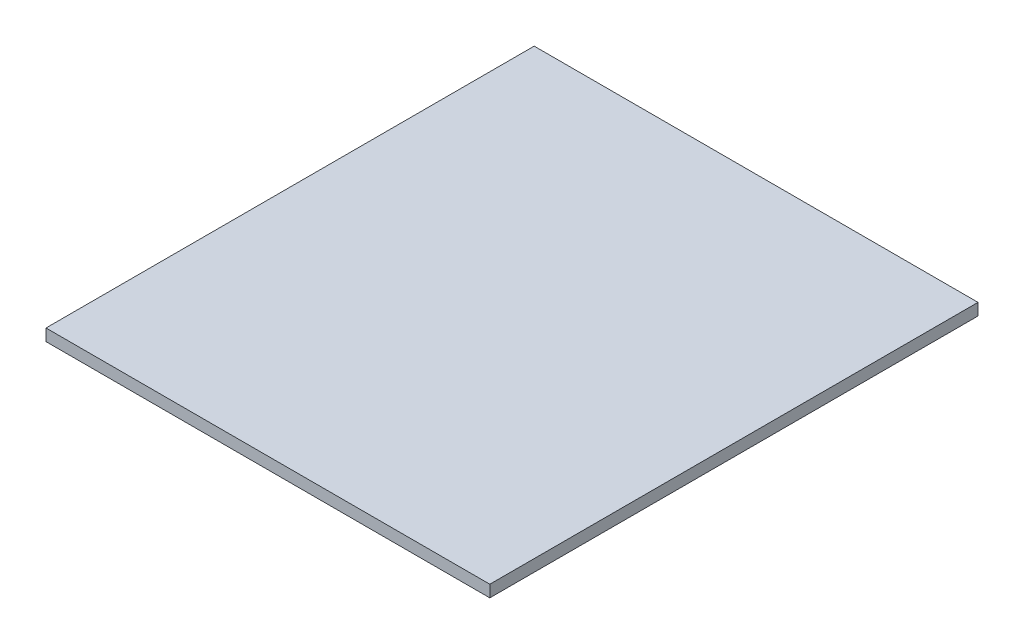
ISO-10303-21;
HEADER;
FILE_DESCRIPTION(('STEP AP214'),'2;1');
FILE_NAME('part.step','',(''),(''),'','','');
FILE_SCHEMA(('AUTOMOTIVE_DESIGN { 1 0 10303 214 1 1 1 1 }'));
ENDSEC;
DATA;
#1=APPLICATION_CONTEXT('core data for automotive mechanical design processes');
#2=APPLICATION_PROTOCOL_DEFINITION('international standard','automotive_design',2000,#1);
#3=PRODUCT_CONTEXT('',#1,'mechanical');
#4=PRODUCT('Part','Part','',(#3));
#5=PRODUCT_RELATED_PRODUCT_CATEGORY('part','',(#4));
#6=PRODUCT_DEFINITION_FORMATION('','',#4);
#7=PRODUCT_DEFINITION_CONTEXT('part definition',#1,'design');
#8=PRODUCT_DEFINITION('design','',#6,#7);
#9=PRODUCT_DEFINITION_SHAPE('','',#8);
#10=(LENGTH_UNIT() NAMED_UNIT(*) SI_UNIT(.MILLI.,.METRE.));
#11=(NAMED_UNIT(*) PLANE_ANGLE_UNIT() SI_UNIT($,.RADIAN.));
#12=(NAMED_UNIT(*) SI_UNIT($,.STERADIAN.) SOLID_ANGLE_UNIT());
#13=UNCERTAINTY_MEASURE_WITH_UNIT(LENGTH_MEASURE(1.E-05),#10,'distance_accuracy_value','');
#14=(GEOMETRIC_REPRESENTATION_CONTEXT(3) GLOBAL_UNCERTAINTY_ASSIGNED_CONTEXT((#13)) GLOBAL_UNIT_ASSIGNED_CONTEXT((#10,
#11,#12)) REPRESENTATION_CONTEXT('',''));
#15=CARTESIAN_POINT('',(0.,0.,0.));
#16=DIRECTION('',(0.,0.,1.));
#17=DIRECTION('',(1.,0.,0.));
#18=AXIS2_PLACEMENT_3D('',#15,#16,#17);
#19=CARTESIAN_POINT('',(0.,4.,0.));
#20=DIRECTION('',(1.,0.,0.));
#21=DIRECTION('',(0.,0.,-1.));
#22=AXIS2_PLACEMENT_3D('',#19,#20,#21);
#23=PLANE('',#22);
#24=DIRECTION('',(0.,0.,1.));
#25=VECTOR('',#24,1.);
#26=CARTESIAN_POINT('',(0.,0.,0.));
#27=LINE('',#26,#25);
#28=CARTESIAN_POINT('',(0.,0.,-165.));
#29=VERTEX_POINT('',#28);
#30=CARTESIAN_POINT('',(0.,0.,0.));
#31=VERTEX_POINT('',#30);
#32=EDGE_CURVE('E101',#29,#31,#27,.T.);
#33=ORIENTED_EDGE('',*,*,#32,.T.);
#34=DIRECTION('',(0.,-1.,0.));
#35=VECTOR('',#34,1.);
#36=CARTESIAN_POINT('',(0.,4.,0.));
#37=LINE('',#36,#35);
#38=CARTESIAN_POINT('',(0.,4.,0.));
#39=VERTEX_POINT('',#38);
#40=EDGE_CURVE('E11',#39,#31,#37,.T.);
#41=ORIENTED_EDGE('',*,*,#40,.F.);
#42=DIRECTION('',(0.,0.,1.));
#43=VECTOR('',#42,1.);
#44=CARTESIAN_POINT('',(0.,4.,0.));
#45=LINE('',#44,#43);
#46=CARTESIAN_POINT('',(0.,4.,-165.));
#47=VERTEX_POINT('',#46);
#48=EDGE_CURVE('E89',#47,#39,#45,.T.);
#49=ORIENTED_EDGE('',*,*,#48,.F.);
#50=DIRECTION('',(0.,-1.,0.));
#51=VECTOR('',#50,1.);
#52=CARTESIAN_POINT('',(0.,4.,-165.));
#53=LINE('',#52,#51);
#54=EDGE_CURVE('E97',#47,#29,#53,.T.);
#55=ORIENTED_EDGE('',*,*,#54,.T.);
#56=EDGE_LOOP('',(#33,#41,#49,#55));
#57=FACE_BOUND('',#56,.T.);
#58=ADVANCED_FACE('F38',(#57),#23,.F.);
#59=CARTESIAN_POINT('',(0.,4.,0.));
#60=DIRECTION('',(0.,0.,-1.));
#61=DIRECTION('',(-1.,0.,0.));
#62=AXIS2_PLACEMENT_3D('',#59,#60,#61);
#63=PLANE('',#62);
#64=DIRECTION('',(1.,0.,0.));
#65=VECTOR('',#64,1.);
#66=CARTESIAN_POINT('',(0.,0.,0.));
#67=LINE('',#66,#65);
#68=CARTESIAN_POINT('',(150.,0.,0.));
#69=VERTEX_POINT('',#68);
#70=EDGE_CURVE('E93',#31,#69,#67,.T.);
#71=ORIENTED_EDGE('',*,*,#70,.T.);
#72=DIRECTION('',(0.,-1.,0.));
#73=VECTOR('',#72,1.);
#74=CARTESIAN_POINT('',(150.,4.,0.));
#75=LINE('',#74,#73);
#76=CARTESIAN_POINT('',(150.,4.,0.));
#77=VERTEX_POINT('',#76);
#78=EDGE_CURVE('E46',#77,#69,#75,.T.);
#79=ORIENTED_EDGE('',*,*,#78,.F.);
#80=DIRECTION('',(1.,0.,0.));
#81=VECTOR('',#80,1.);
#82=CARTESIAN_POINT('',(0.,4.,0.));
#83=LINE('',#82,#81);
#84=EDGE_CURVE('E84',#39,#77,#83,.T.);
#85=ORIENTED_EDGE('',*,*,#84,.F.);
#86=ORIENTED_EDGE('',*,*,#40,.T.);
#87=EDGE_LOOP('',(#71,#79,#85,#86));
#88=FACE_BOUND('',#87,.T.);
#89=ADVANCED_FACE('F92',(#88),#63,.F.);
#90=CARTESIAN_POINT('',(150.,4.,0.));
#91=DIRECTION('',(-1.,0.,0.));
#92=DIRECTION('',(0.,0.,1.));
#93=AXIS2_PLACEMENT_3D('',#90,#91,#92);
#94=PLANE('',#93);
#95=DIRECTION('',(0.,0.,-1.));
#96=VECTOR('',#95,1.);
#97=CARTESIAN_POINT('',(150.,0.,0.));
#98=LINE('',#97,#96);
#99=CARTESIAN_POINT('',(150.,0.,-165.));
#100=VERTEX_POINT('',#99);
#101=EDGE_CURVE('E71',#69,#100,#98,.T.);
#102=ORIENTED_EDGE('',*,*,#101,.T.);
#103=DIRECTION('',(0.,-1.,0.));
#104=VECTOR('',#103,1.);
#105=CARTESIAN_POINT('',(150.,4.,-165.));
#106=LINE('',#105,#104);
#107=CARTESIAN_POINT('',(150.,4.,-165.));
#108=VERTEX_POINT('',#107);
#109=EDGE_CURVE('E94',#108,#100,#106,.T.);
#110=ORIENTED_EDGE('',*,*,#109,.F.);
#111=DIRECTION('',(0.,0.,-1.));
#112=VECTOR('',#111,1.);
#113=CARTESIAN_POINT('',(150.,4.,0.));
#114=LINE('',#113,#112);
#115=EDGE_CURVE('E87',#77,#108,#114,.T.);
#116=ORIENTED_EDGE('',*,*,#115,.F.);
#117=ORIENTED_EDGE('',*,*,#78,.T.);
#118=EDGE_LOOP('',(#102,#110,#116,#117));
#119=FACE_BOUND('',#118,.T.);
#120=ADVANCED_FACE('F95',(#119),#94,.F.);
#121=CARTESIAN_POINT('',(0.,4.,-165.));
#122=DIRECTION('',(0.,0.,1.));
#123=DIRECTION('',(1.,0.,0.));
#124=AXIS2_PLACEMENT_3D('',#121,#122,#123);
#125=PLANE('',#124);
#126=DIRECTION('',(-1.,0.,0.));
#127=VECTOR('',#126,1.);
#128=CARTESIAN_POINT('',(0.,0.,-165.));
#129=LINE('',#128,#127);
#130=EDGE_CURVE('E77',#100,#29,#129,.T.);
#131=ORIENTED_EDGE('',*,*,#130,.T.);
#132=ORIENTED_EDGE('',*,*,#54,.F.);
#133=DIRECTION('',(-1.,0.,0.));
#134=VECTOR('',#133,1.);
#135=CARTESIAN_POINT('',(0.,4.,-165.));
#136=LINE('',#135,#134);
#137=EDGE_CURVE('E54',#108,#47,#136,.T.);
#138=ORIENTED_EDGE('',*,*,#137,.F.);
#139=ORIENTED_EDGE('',*,*,#109,.T.);
#140=EDGE_LOOP('',(#131,#132,#138,#139));
#141=FACE_BOUND('',#140,.T.);
#142=ADVANCED_FACE('F108',(#141),#125,.F.);
#143=CARTESIAN_POINT('',(0.,4.,0.));
#144=DIRECTION('',(0.,-1.,0.));
#145=DIRECTION('',(0.,0.,-1.));
#146=AXIS2_PLACEMENT_3D('',#143,#144,#145);
#147=PLANE('',#146);
#148=ORIENTED_EDGE('',*,*,#48,.T.);
#149=ORIENTED_EDGE('',*,*,#84,.T.);
#150=ORIENTED_EDGE('',*,*,#115,.T.);
#151=ORIENTED_EDGE('',*,*,#137,.T.);
#152=EDGE_LOOP('',(#148,#149,#150,#151));
#153=FACE_BOUND('',#152,.T.);
#154=ADVANCED_FACE('F85',(#153),#147,.F.);
#155=CARTESIAN_POINT('',(0.,0.,0.));
#156=DIRECTION('',(0.,-1.,0.));
#157=DIRECTION('',(0.,0.,-1.));
#158=AXIS2_PLACEMENT_3D('',#155,#156,#157);
#159=PLANE('',#158);
#160=ORIENTED_EDGE('',*,*,#32,.F.);
#161=ORIENTED_EDGE('',*,*,#130,.F.);
#162=ORIENTED_EDGE('',*,*,#101,.F.);
#163=ORIENTED_EDGE('',*,*,#70,.F.);
#164=EDGE_LOOP('',(#160,#161,#162,#163));
#165=FACE_BOUND('',#164,.T.);
#166=ADVANCED_FACE('F111',(#165),#159,.T.);
#167=CLOSED_SHELL('',(#58,#89,#120,#142,#154,#166));
#168=MANIFOLD_SOLID_BREP('B2',#167);
#169=ADVANCED_BREP_SHAPE_REPRESENTATION('',(#18,#168),#14);
#170=SHAPE_DEFINITION_REPRESENTATION(#9,#169);
ENDSEC;
END-ISO-10303-21;
